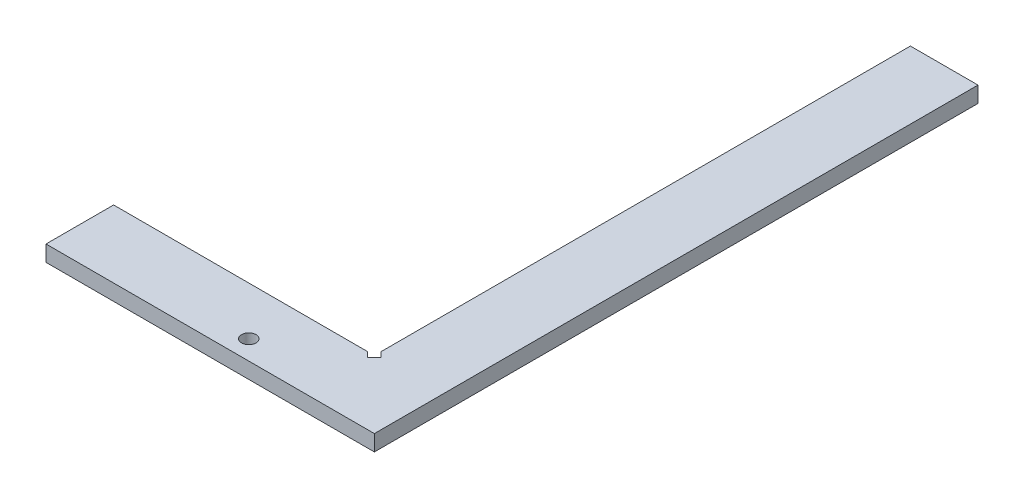
ISO-10303-21;
HEADER;
FILE_DESCRIPTION(('STEP AP214'),'2;1');
FILE_NAME('part.step','',(''),(''),'','','');
FILE_SCHEMA(('AUTOMOTIVE_DESIGN { 1 0 10303 214 1 1 1 1 }'));
ENDSEC;
DATA;
#1=APPLICATION_CONTEXT('core data for automotive mechanical design processes');
#2=APPLICATION_PROTOCOL_DEFINITION('international standard','automotive_design',2000,#1);
#3=PRODUCT_CONTEXT('',#1,'mechanical');
#4=PRODUCT('Part','Part','',(#3));
#5=PRODUCT_RELATED_PRODUCT_CATEGORY('part','',(#4));
#6=PRODUCT_DEFINITION_FORMATION('','',#4);
#7=PRODUCT_DEFINITION_CONTEXT('part definition',#1,'design');
#8=PRODUCT_DEFINITION('design','',#6,#7);
#9=PRODUCT_DEFINITION_SHAPE('','',#8);
#10=(LENGTH_UNIT() NAMED_UNIT(*) SI_UNIT(.MILLI.,.METRE.));
#11=(NAMED_UNIT(*) PLANE_ANGLE_UNIT() SI_UNIT($,.RADIAN.));
#12=(NAMED_UNIT(*) SI_UNIT($,.STERADIAN.) SOLID_ANGLE_UNIT());
#13=UNCERTAINTY_MEASURE_WITH_UNIT(LENGTH_MEASURE(1.E-05),#10,'distance_accuracy_value','');
#14=(GEOMETRIC_REPRESENTATION_CONTEXT(3) GLOBAL_UNCERTAINTY_ASSIGNED_CONTEXT((#13)) GLOBAL_UNIT_ASSIGNED_CONTEXT((#10,
#11,#12)) REPRESENTATION_CONTEXT('',''));
#15=CARTESIAN_POINT('',(0.,0.,0.));
#16=DIRECTION('',(0.,0.,1.));
#17=DIRECTION('',(1.,0.,0.));
#18=AXIS2_PLACEMENT_3D('',#15,#16,#17);
#19=CARTESIAN_POINT('',(0.,3.3,0.));
#20=DIRECTION('',(0.,1.,0.));
#21=DIRECTION('',(0.,0.,1.));
#22=AXIS2_PLACEMENT_3D('',#19,#20,#21);
#23=PLANE('',#22);
#24=DIRECTION('',(-0.707106781186545,0.,-0.707106781186551));
#25=VECTOR('',#24,1.);
#26=CARTESIAN_POINT('',(-12.9393398282202,3.3,-14.3393398282202));
#27=LINE('',#26,#25);
#28=CARTESIAN_POINT('',(-12.9393398282202,3.3,-14.3393398282202));
#29=VERTEX_POINT('',#28);
#30=CARTESIAN_POINT('',(-14.,3.3,-15.4));
#31=VERTEX_POINT('',#30);
#32=EDGE_CURVE('E168',#29,#31,#27,.T.);
#33=ORIENTED_EDGE('',*,*,#32,.F.);
#34=DIRECTION('',(0.70710678118655,0.,-0.707106781186545));
#35=VECTOR('',#34,1.);
#36=CARTESIAN_POINT('',(-14.3393398282202,3.3,-12.9393398282202));
#37=LINE('',#36,#35);
#38=CARTESIAN_POINT('',(-14.3393398282202,3.3,-12.9393398282202));
#39=VERTEX_POINT('',#38);
#40=EDGE_CURVE('E184',#39,#29,#37,.T.);
#41=ORIENTED_EDGE('',*,*,#40,.F.);
#42=DIRECTION('',(0.707106781186544,0.,0.707106781186551));
#43=VECTOR('',#42,1.);
#44=CARTESIAN_POINT('',(-15.4,3.3,-14.));
#45=LINE('',#44,#43);
#46=CARTESIAN_POINT('',(-15.4,3.3,-14.));
#47=VERTEX_POINT('',#46);
#48=EDGE_CURVE('E174',#47,#39,#45,.T.);
#49=ORIENTED_EDGE('',*,*,#48,.F.);
#50=DIRECTION('',(-1.,0.,0.));
#51=VECTOR('',#50,1.);
#52=CARTESIAN_POINT('',(-14.,3.3,-14.));
#53=LINE('',#52,#51);
#54=CARTESIAN_POINT('',(-68.,3.3,-14.));
#55=VERTEX_POINT('',#54);
#56=EDGE_CURVE('E122',#47,#55,#53,.T.);
#57=ORIENTED_EDGE('',*,*,#56,.T.);
#58=DIRECTION('',(0.,0.,1.));
#59=VECTOR('',#58,1.);
#60=CARTESIAN_POINT('',(-68.,3.3,-14.));
#61=LINE('',#60,#59);
#62=CARTESIAN_POINT('',(-68.,3.3,0.));
#63=VERTEX_POINT('',#62);
#64=EDGE_CURVE('E59',#55,#63,#61,.T.);
#65=ORIENTED_EDGE('',*,*,#64,.T.);
#66=DIRECTION('',(1.,0.,0.));
#67=VECTOR('',#66,1.);
#68=CARTESIAN_POINT('',(-68.,3.3,0.));
#69=LINE('',#68,#67);
#70=CARTESIAN_POINT('',(0.,3.3,0.));
#71=VERTEX_POINT('',#70);
#72=EDGE_CURVE('E141',#63,#71,#69,.T.);
#73=ORIENTED_EDGE('',*,*,#72,.T.);
#74=DIRECTION('',(0.,0.,-1.));
#75=VECTOR('',#74,1.);
#76=CARTESIAN_POINT('',(0.,3.3,0.));
#77=LINE('',#76,#75);
#78=CARTESIAN_POINT('',(0.,3.3,-125.));
#79=VERTEX_POINT('',#78);
#80=EDGE_CURVE('E91',#71,#79,#77,.T.);
#81=ORIENTED_EDGE('',*,*,#80,.T.);
#82=DIRECTION('',(-1.,0.,0.));
#83=VECTOR('',#82,1.);
#84=CARTESIAN_POINT('',(0.,3.3,-125.));
#85=LINE('',#84,#83);
#86=CARTESIAN_POINT('',(-14.,3.3,-125.));
#87=VERTEX_POINT('',#86);
#88=EDGE_CURVE('E99',#79,#87,#85,.T.);
#89=ORIENTED_EDGE('',*,*,#88,.T.);
#90=DIRECTION('',(0.,0.,1.));
#91=VECTOR('',#90,1.);
#92=CARTESIAN_POINT('',(-14.,3.3,-125.));
#93=LINE('',#92,#91);
#94=EDGE_CURVE('E104',#87,#31,#93,.T.);
#95=ORIENTED_EDGE('',*,*,#94,.T.);
#96=EDGE_LOOP('',(#33,#41,#49,#57,#65,#73,#81,#89,#95));
#97=FACE_BOUND('',#96,.T.);
#98=CARTESIAN_POINT('',(-30.,3.3,-4.));
#99=DIRECTION('',(0.,1.,0.));
#100=DIRECTION('',(0.,0.,1.));
#101=AXIS2_PLACEMENT_3D('',#98,#99,#100);
#102=CIRCLE('',#101,1.5);
#103=CARTESIAN_POINT('',(-30.,3.3,-2.5));
#104=VERTEX_POINT('',#103);
#105=EDGE_CURVE('E133',#104,#104,#102,.T.);
#106=ORIENTED_EDGE('',*,*,#105,.F.);
#107=EDGE_LOOP('',(#106));
#108=FACE_BOUND('',#107,.T.);
#109=ADVANCED_FACE('F35',(#97,#108),#23,.T.);
#110=CARTESIAN_POINT('',(0.,0.,0.));
#111=DIRECTION('',(0.,1.,0.));
#112=DIRECTION('',(0.,0.,1.));
#113=AXIS2_PLACEMENT_3D('',#110,#111,#112);
#114=PLANE('',#113);
#115=DIRECTION('',(0.70710678118655,0.,-0.707106781186545));
#116=VECTOR('',#115,1.);
#117=CARTESIAN_POINT('',(-14.3393398282202,0.,-12.9393398282202));
#118=LINE('',#117,#116);
#119=CARTESIAN_POINT('',(-14.3393398282202,0.,-12.9393398282202));
#120=VERTEX_POINT('',#119);
#121=CARTESIAN_POINT('',(-12.9393398282202,0.,-14.3393398282202));
#122=VERTEX_POINT('',#121);
#123=EDGE_CURVE('E179',#120,#122,#118,.T.);
#124=ORIENTED_EDGE('',*,*,#123,.T.);
#125=DIRECTION('',(-0.707106781186545,0.,-0.707106781186551));
#126=VECTOR('',#125,1.);
#127=CARTESIAN_POINT('',(-12.9393398282202,0.,-14.3393398282202));
#128=LINE('',#127,#126);
#129=CARTESIAN_POINT('',(-14.,0.,-15.4));
#130=VERTEX_POINT('',#129);
#131=EDGE_CURVE('E150',#122,#130,#128,.T.);
#132=ORIENTED_EDGE('',*,*,#131,.T.);
#133=DIRECTION('',(0.,0.,1.));
#134=VECTOR('',#133,1.);
#135=CARTESIAN_POINT('',(-14.,0.,-125.));
#136=LINE('',#135,#134);
#137=CARTESIAN_POINT('',(-14.,0.,-125.));
#138=VERTEX_POINT('',#137);
#139=EDGE_CURVE('E136',#138,#130,#136,.T.);
#140=ORIENTED_EDGE('',*,*,#139,.F.);
#141=DIRECTION('',(-1.,0.,0.));
#142=VECTOR('',#141,1.);
#143=CARTESIAN_POINT('',(0.,0.,-125.));
#144=LINE('',#143,#142);
#145=CARTESIAN_POINT('',(0.,0.,-125.));
#146=VERTEX_POINT('',#145);
#147=EDGE_CURVE('E112',#146,#138,#144,.T.);
#148=ORIENTED_EDGE('',*,*,#147,.F.);
#149=DIRECTION('',(0.,0.,-1.));
#150=VECTOR('',#149,1.);
#151=CARTESIAN_POINT('',(0.,0.,0.));
#152=LINE('',#151,#150);
#153=CARTESIAN_POINT('',(0.,0.,0.));
#154=VERTEX_POINT('',#153);
#155=EDGE_CURVE('E132',#154,#146,#152,.T.);
#156=ORIENTED_EDGE('',*,*,#155,.F.);
#157=DIRECTION('',(1.,0.,0.));
#158=VECTOR('',#157,1.);
#159=CARTESIAN_POINT('',(-68.,0.,0.));
#160=LINE('',#159,#158);
#161=CARTESIAN_POINT('',(-68.,0.,0.));
#162=VERTEX_POINT('',#161);
#163=EDGE_CURVE('E129',#162,#154,#160,.T.);
#164=ORIENTED_EDGE('',*,*,#163,.F.);
#165=DIRECTION('',(0.,0.,1.));
#166=VECTOR('',#165,1.);
#167=CARTESIAN_POINT('',(-68.,0.,-14.));
#168=LINE('',#167,#166);
#169=CARTESIAN_POINT('',(-68.,0.,-14.));
#170=VERTEX_POINT('',#169);
#171=EDGE_CURVE('E83',#170,#162,#168,.T.);
#172=ORIENTED_EDGE('',*,*,#171,.F.);
#173=DIRECTION('',(-1.,0.,0.));
#174=VECTOR('',#173,1.);
#175=CARTESIAN_POINT('',(-14.,0.,-14.));
#176=LINE('',#175,#174);
#177=CARTESIAN_POINT('',(-15.4,0.,-14.));
#178=VERTEX_POINT('',#177);
#179=EDGE_CURVE('E138',#178,#170,#176,.T.);
#180=ORIENTED_EDGE('',*,*,#179,.F.);
#181=DIRECTION('',(0.707106781186544,0.,0.707106781186551));
#182=VECTOR('',#181,1.);
#183=CARTESIAN_POINT('',(-15.4,0.,-14.));
#184=LINE('',#183,#182);
#185=EDGE_CURVE('E50',#178,#120,#184,.T.);
#186=ORIENTED_EDGE('',*,*,#185,.T.);
#187=EDGE_LOOP('',(#124,#132,#140,#148,#156,#164,#172,#180,#186));
#188=FACE_BOUND('',#187,.T.);
#189=CARTESIAN_POINT('',(-30.,0.,-4.));
#190=DIRECTION('',(0.,1.,0.));
#191=DIRECTION('',(0.,0.,1.));
#192=AXIS2_PLACEMENT_3D('',#189,#190,#191);
#193=CIRCLE('',#192,1.5);
#194=CARTESIAN_POINT('',(-30.,0.,-2.5));
#195=VERTEX_POINT('',#194);
#196=EDGE_CURVE('E191',#195,#195,#193,.T.);
#197=ORIENTED_EDGE('',*,*,#196,.T.);
#198=EDGE_LOOP('',(#197));
#199=FACE_BOUND('',#198,.T.);
#200=ADVANCED_FACE('F145',(#188,#199),#114,.F.);
#201=CARTESIAN_POINT('',(-68.,3.3,0.));
#202=DIRECTION('',(0.,0.,-1.));
#203=DIRECTION('',(-1.,0.,0.));
#204=AXIS2_PLACEMENT_3D('',#201,#202,#203);
#205=PLANE('',#204);
#206=ORIENTED_EDGE('',*,*,#163,.T.);
#207=DIRECTION('',(0.,-1.,0.));
#208=VECTOR('',#207,1.);
#209=CARTESIAN_POINT('',(0.,3.3,0.));
#210=LINE('',#209,#208);
#211=EDGE_CURVE('E11',#71,#154,#210,.T.);
#212=ORIENTED_EDGE('',*,*,#211,.F.);
#213=ORIENTED_EDGE('',*,*,#72,.F.);
#214=DIRECTION('',(0.,-1.,0.));
#215=VECTOR('',#214,1.);
#216=CARTESIAN_POINT('',(-68.,3.3,0.));
#217=LINE('',#216,#215);
#218=EDGE_CURVE('E128',#63,#162,#217,.T.);
#219=ORIENTED_EDGE('',*,*,#218,.T.);
#220=EDGE_LOOP('',(#206,#212,#213,#219));
#221=FACE_BOUND('',#220,.T.);
#222=ADVANCED_FACE('F37',(#221),#205,.F.);
#223=CARTESIAN_POINT('',(0.,3.3,0.));
#224=DIRECTION('',(-1.,0.,0.));
#225=DIRECTION('',(0.,0.,1.));
#226=AXIS2_PLACEMENT_3D('',#223,#224,#225);
#227=PLANE('',#226);
#228=ORIENTED_EDGE('',*,*,#155,.T.);
#229=DIRECTION('',(0.,-1.,0.));
#230=VECTOR('',#229,1.);
#231=CARTESIAN_POINT('',(0.,3.3,-125.));
#232=LINE('',#231,#230);
#233=EDGE_CURVE('E43',#79,#146,#232,.T.);
#234=ORIENTED_EDGE('',*,*,#233,.F.);
#235=ORIENTED_EDGE('',*,*,#80,.F.);
#236=ORIENTED_EDGE('',*,*,#211,.T.);
#237=EDGE_LOOP('',(#228,#234,#235,#236));
#238=FACE_BOUND('',#237,.T.);
#239=ADVANCED_FACE('F201',(#238),#227,.F.);
#240=CARTESIAN_POINT('',(0.,3.3,-125.));
#241=DIRECTION('',(0.,0.,1.));
#242=DIRECTION('',(1.,0.,0.));
#243=AXIS2_PLACEMENT_3D('',#240,#241,#242);
#244=PLANE('',#243);
#245=ORIENTED_EDGE('',*,*,#147,.T.);
#246=DIRECTION('',(0.,-1.,0.));
#247=VECTOR('',#246,1.);
#248=CARTESIAN_POINT('',(-14.,3.3,-125.));
#249=LINE('',#248,#247);
#250=EDGE_CURVE('E109',#87,#138,#249,.T.);
#251=ORIENTED_EDGE('',*,*,#250,.F.);
#252=ORIENTED_EDGE('',*,*,#88,.F.);
#253=ORIENTED_EDGE('',*,*,#233,.T.);
#254=EDGE_LOOP('',(#245,#251,#252,#253));
#255=FACE_BOUND('',#254,.T.);
#256=ADVANCED_FACE('F110',(#255),#244,.F.);
#257=CARTESIAN_POINT('',(-14.,3.3,-125.));
#258=DIRECTION('',(1.,0.,0.));
#259=DIRECTION('',(0.,0.,-1.));
#260=AXIS2_PLACEMENT_3D('',#257,#258,#259);
#261=PLANE('',#260);
#262=ORIENTED_EDGE('',*,*,#139,.T.);
#263=DIRECTION('',(0.,1.,0.));
#264=VECTOR('',#263,1.);
#265=CARTESIAN_POINT('',(-14.,0.,-15.4));
#266=LINE('',#265,#264);
#267=EDGE_CURVE('E121',#130,#31,#266,.T.);
#268=ORIENTED_EDGE('',*,*,#267,.T.);
#269=ORIENTED_EDGE('',*,*,#94,.F.);
#270=ORIENTED_EDGE('',*,*,#250,.T.);
#271=EDGE_LOOP('',(#262,#268,#269,#270));
#272=FACE_BOUND('',#271,.T.);
#273=ADVANCED_FACE('F119',(#272),#261,.F.);
#274=CARTESIAN_POINT('',(-14.,3.3,-14.));
#275=DIRECTION('',(0.,0.,1.));
#276=DIRECTION('',(1.,0.,0.));
#277=AXIS2_PLACEMENT_3D('',#274,#275,#276);
#278=PLANE('',#277);
#279=ORIENTED_EDGE('',*,*,#56,.F.);
#280=DIRECTION('',(0.,1.,0.));
#281=VECTOR('',#280,1.);
#282=CARTESIAN_POINT('',(-15.4,0.,-14.));
#283=LINE('',#282,#281);
#284=EDGE_CURVE('E177',#178,#47,#283,.T.);
#285=ORIENTED_EDGE('',*,*,#284,.F.);
#286=ORIENTED_EDGE('',*,*,#179,.T.);
#287=DIRECTION('',(0.,-1.,0.));
#288=VECTOR('',#287,1.);
#289=CARTESIAN_POINT('',(-68.,3.3,-14.));
#290=LINE('',#289,#288);
#291=EDGE_CURVE('E116',#55,#170,#290,.T.);
#292=ORIENTED_EDGE('',*,*,#291,.F.);
#293=EDGE_LOOP('',(#279,#285,#286,#292));
#294=FACE_BOUND('',#293,.T.);
#295=ADVANCED_FACE('F221',(#294),#278,.F.);
#296=CARTESIAN_POINT('',(-68.,3.3,-14.));
#297=DIRECTION('',(1.,0.,0.));
#298=DIRECTION('',(0.,0.,-1.));
#299=AXIS2_PLACEMENT_3D('',#296,#297,#298);
#300=PLANE('',#299);
#301=ORIENTED_EDGE('',*,*,#171,.T.);
#302=ORIENTED_EDGE('',*,*,#218,.F.);
#303=ORIENTED_EDGE('',*,*,#64,.F.);
#304=ORIENTED_EDGE('',*,*,#291,.T.);
#305=EDGE_LOOP('',(#301,#302,#303,#304));
#306=FACE_BOUND('',#305,.T.);
#307=ADVANCED_FACE('F218',(#306),#300,.F.);
#308=CARTESIAN_POINT('',(-30.,3.3,-4.));
#309=DIRECTION('',(0.,-1.,0.));
#310=DIRECTION('',(0.,0.,-1.));
#311=AXIS2_PLACEMENT_3D('',#308,#309,#310);
#312=CYLINDRICAL_SURFACE('',#311,1.5);
#313=ORIENTED_EDGE('',*,*,#105,.T.);
#314=EDGE_LOOP('',(#313));
#315=FACE_BOUND('',#314,.T.);
#316=ORIENTED_EDGE('',*,*,#196,.F.);
#317=EDGE_LOOP('',(#316));
#318=FACE_BOUND('',#317,.T.);
#319=ADVANCED_FACE('F215',(#315,#318),#312,.F.);
#320=CARTESIAN_POINT('',(-12.9393398282202,0.,-14.3393398282202));
#321=DIRECTION('',(0.707106781186551,0.,-0.707106781186545));
#322=DIRECTION('',(-0.707106781186545,0.,-0.707106781186551));
#323=AXIS2_PLACEMENT_3D('',#320,#321,#322);
#324=PLANE('',#323);
#325=ORIENTED_EDGE('',*,*,#32,.T.);
#326=ORIENTED_EDGE('',*,*,#267,.F.);
#327=ORIENTED_EDGE('',*,*,#131,.F.);
#328=DIRECTION('',(0.,1.,0.));
#329=VECTOR('',#328,1.);
#330=CARTESIAN_POINT('',(-12.9393398282202,0.,-14.3393398282202));
#331=LINE('',#330,#329);
#332=EDGE_CURVE('E166',#122,#29,#331,.T.);
#333=ORIENTED_EDGE('',*,*,#332,.T.);
#334=EDGE_LOOP('',(#325,#326,#327,#333));
#335=FACE_BOUND('',#334,.T.);
#336=ADVANCED_FACE('F246',(#335),#324,.F.);
#337=CARTESIAN_POINT('',(-14.3393398282202,0.,-12.9393398282202));
#338=DIRECTION('',(0.707106781186545,0.,0.70710678118655));
#339=DIRECTION('',(0.70710678118655,0.,-0.707106781186545));
#340=AXIS2_PLACEMENT_3D('',#337,#338,#339);
#341=PLANE('',#340);
#342=ORIENTED_EDGE('',*,*,#40,.T.);
#343=ORIENTED_EDGE('',*,*,#332,.F.);
#344=ORIENTED_EDGE('',*,*,#123,.F.);
#345=DIRECTION('',(0.,1.,0.));
#346=VECTOR('',#345,1.);
#347=CARTESIAN_POINT('',(-14.3393398282202,0.,-12.9393398282202));
#348=LINE('',#347,#346);
#349=EDGE_CURVE('E170',#120,#39,#348,.T.);
#350=ORIENTED_EDGE('',*,*,#349,.T.);
#351=EDGE_LOOP('',(#342,#343,#344,#350));
#352=FACE_BOUND('',#351,.T.);
#353=ADVANCED_FACE('F180',(#352),#341,.F.);
#354=CARTESIAN_POINT('',(-15.4,0.,-14.));
#355=DIRECTION('',(-0.707106781186551,0.,0.707106781186544));
#356=DIRECTION('',(0.707106781186544,0.,0.707106781186551));
#357=AXIS2_PLACEMENT_3D('',#354,#355,#356);
#358=PLANE('',#357);
#359=ORIENTED_EDGE('',*,*,#48,.T.);
#360=ORIENTED_EDGE('',*,*,#349,.F.);
#361=ORIENTED_EDGE('',*,*,#185,.F.);
#362=ORIENTED_EDGE('',*,*,#284,.T.);
#363=EDGE_LOOP('',(#359,#360,#361,#362));
#364=FACE_BOUND('',#363,.T.);
#365=ADVANCED_FACE('F172',(#364),#358,.F.);
#366=CLOSED_SHELL('',(#109,#200,#222,#239,#256,#273,#295,#307,#319,#336,#353,#365));
#367=MANIFOLD_SOLID_BREP('B2',#366);
#368=ADVANCED_BREP_SHAPE_REPRESENTATION('',(#18,#367),#14);
#369=SHAPE_DEFINITION_REPRESENTATION(#9,#368);
ENDSEC;
END-ISO-10303-21;
